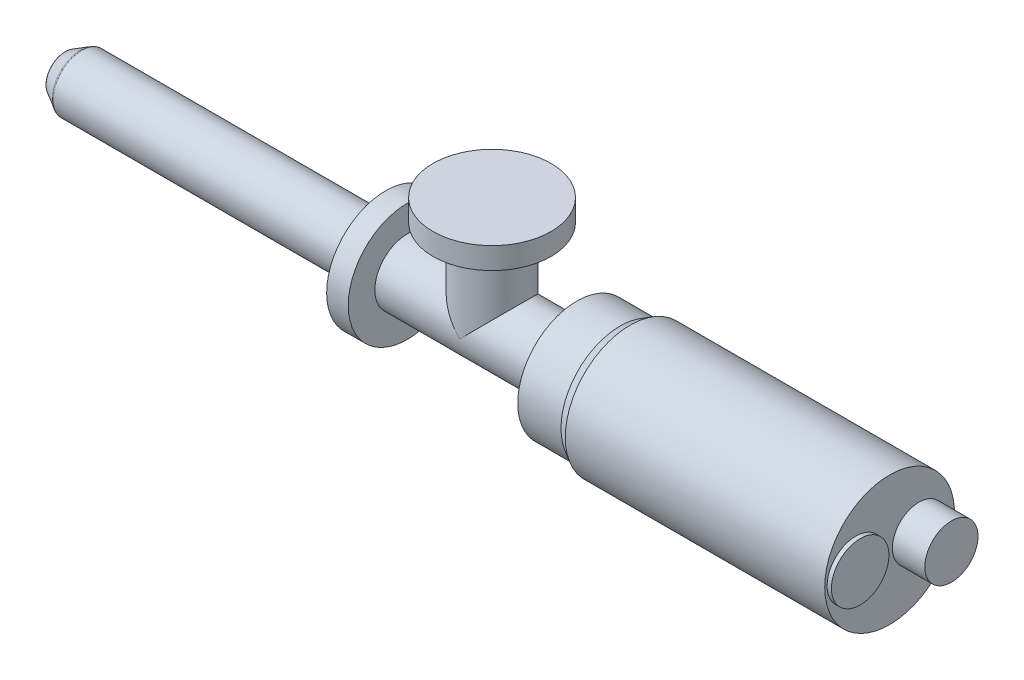
ISO-10303-21;
HEADER;
FILE_DESCRIPTION(('STEP AP214'),'2;1');
FILE_NAME('part.step','',(''),(''),'','','');
FILE_SCHEMA(('AUTOMOTIVE_DESIGN { 1 0 10303 214 1 1 1 1 }'));
ENDSEC;
DATA;
#1=APPLICATION_CONTEXT('core data for automotive mechanical design processes');
#2=APPLICATION_PROTOCOL_DEFINITION('international standard','automotive_design',2000,#1);
#3=PRODUCT_CONTEXT('',#1,'mechanical');
#4=PRODUCT('Part','Part','',(#3));
#5=PRODUCT_RELATED_PRODUCT_CATEGORY('part','',(#4));
#6=PRODUCT_DEFINITION_FORMATION('','',#4);
#7=PRODUCT_DEFINITION_CONTEXT('part definition',#1,'design');
#8=PRODUCT_DEFINITION('design','',#6,#7);
#9=PRODUCT_DEFINITION_SHAPE('','',#8);
#10=(LENGTH_UNIT() NAMED_UNIT(*) SI_UNIT(.MILLI.,.METRE.));
#11=(NAMED_UNIT(*) PLANE_ANGLE_UNIT() SI_UNIT($,.RADIAN.));
#12=(NAMED_UNIT(*) SI_UNIT($,.STERADIAN.) SOLID_ANGLE_UNIT());
#13=UNCERTAINTY_MEASURE_WITH_UNIT(LENGTH_MEASURE(1.E-05),#10,'distance_accuracy_value','');
#14=(GEOMETRIC_REPRESENTATION_CONTEXT(3) GLOBAL_UNCERTAINTY_ASSIGNED_CONTEXT((#13)) GLOBAL_UNIT_ASSIGNED_CONTEXT((#10,
#11,#12)) REPRESENTATION_CONTEXT('',''));
#15=CARTESIAN_POINT('',(0.,0.,0.));
#16=DIRECTION('',(0.,0.,1.));
#17=DIRECTION('',(1.,0.,0.));
#18=AXIS2_PLACEMENT_3D('',#15,#16,#17);
#19=CARTESIAN_POINT('',(484.729202219154,38.1,0.));
#20=DIRECTION('',(-1.,0.,0.));
#21=DIRECTION('',(0.,0.,1.));
#22=AXIS2_PLACEMENT_3D('',#19,#20,#21);
#23=PLANE('',#22);
#24=CARTESIAN_POINT('',(484.729202219154,0.,-17.272));
#25=DIRECTION('',(-1.,0.,0.));
#26=DIRECTION('',(0.,0.,1.));
#27=AXIS2_PLACEMENT_3D('',#24,#25,#26);
#28=CIRCLE('',#27,15.621);
#29=CARTESIAN_POINT('',(484.729202219154,0.,-1.65100000000001));
#30=VERTEX_POINT('',#29);
#31=EDGE_CURVE('E62',#30,#30,#28,.F.);
#32=ORIENTED_EDGE('',*,*,#31,.F.);
#33=EDGE_LOOP('',(#32));
#34=FACE_BOUND('',#33,.T.);
#35=CARTESIAN_POINT('',(484.729202219154,0.,0.));
#36=DIRECTION('',(-1.,0.,0.));
#37=DIRECTION('',(0.,0.,1.));
#38=AXIS2_PLACEMENT_3D('',#35,#36,#37);
#39=CIRCLE('',#38,38.1);
#40=CARTESIAN_POINT('',(484.729202219154,0.,38.1));
#41=VERTEX_POINT('',#40);
#42=EDGE_CURVE('E340',#41,#41,#39,.T.);
#43=ORIENTED_EDGE('',*,*,#42,.F.);
#44=EDGE_LOOP('',(#43));
#45=FACE_BOUND('',#44,.T.);
#46=CARTESIAN_POINT('',(484.729202219154,0.,19.812));
#47=DIRECTION('',(-1.,0.,0.));
#48=DIRECTION('',(0.,0.,1.));
#49=AXIS2_PLACEMENT_3D('',#46,#47,#48);
#50=CIRCLE('',#49,16.891);
#51=CARTESIAN_POINT('',(484.729202219154,0.,36.703));
#52=VERTEX_POINT('',#51);
#53=EDGE_CURVE('E65',#52,#52,#50,.F.);
#54=ORIENTED_EDGE('',*,*,#53,.F.);
#55=EDGE_LOOP('',(#54));
#56=FACE_BOUND('',#55,.T.);
#57=ADVANCED_FACE('F30',(#34,#45,#56),#23,.F.);
#58=CARTESIAN_POINT('',(251.206,62.484,0.));
#59=DIRECTION('',(0.,-1.,0.));
#60=DIRECTION('',(0.,0.,-1.));
#61=AXIS2_PLACEMENT_3D('',#58,#59,#60);
#62=CYLINDRICAL_SURFACE('',#61,19.05);
#63=CARTESIAN_POINT('',(251.206,0.,0.));
#64=DIRECTION('',(-0.707106781186548,0.707106781186547,0.));
#65=DIRECTION('',(-0.707106781186548,-0.707106781186547,0.));
#66=AXIS2_PLACEMENT_3D('',#63,#64,#65);
#67=ELLIPSE('',#66,26.9407683632075,19.05);
#68=CARTESIAN_POINT('',(251.206,0.,19.05));
#69=VERTEX_POINT('',#68);
#70=CARTESIAN_POINT('',(251.206,0.,-19.05));
#71=VERTEX_POINT('',#70);
#72=EDGE_CURVE('E44',#69,#71,#67,.T.);
#73=ORIENTED_EDGE('',*,*,#72,.T.);
#74=CARTESIAN_POINT('',(251.206,0.,0.));
#75=DIRECTION('',(-0.707106781186548,-0.707106781186547,0.));
#76=DIRECTION('',(-0.707106781186548,0.707106781186547,0.));
#77=AXIS2_PLACEMENT_3D('',#74,#75,#76);
#78=ELLIPSE('',#77,26.9407683632075,19.05);
#79=EDGE_CURVE('E46',#71,#69,#78,.F.);
#80=ORIENTED_EDGE('',*,*,#79,.T.);
#81=EDGE_LOOP('',(#73,#80));
#82=FACE_BOUND('',#81,.T.);
#83=CARTESIAN_POINT('',(251.206,49.784,0.));
#84=DIRECTION('',(0.,1.,0.));
#85=DIRECTION('',(0.,0.,1.));
#86=AXIS2_PLACEMENT_3D('',#83,#84,#85);
#87=CIRCLE('',#86,19.05);
#88=CARTESIAN_POINT('',(251.206,49.784,19.05));
#89=VERTEX_POINT('',#88);
#90=EDGE_CURVE('E49',#89,#89,#87,.T.);
#91=ORIENTED_EDGE('',*,*,#90,.F.);
#92=EDGE_LOOP('',(#91));
#93=FACE_BOUND('',#92,.T.);
#94=ADVANCED_FACE('F51',(#82,#93),#62,.T.);
#95=CARTESIAN_POINT('',(0.,0.,0.));
#96=DIRECTION('',(-1.,0.,0.));
#97=DIRECTION('',(0.,0.,1.));
#98=AXIS2_PLACEMENT_3D('',#95,#96,#97);
#99=CYLINDRICAL_SURFACE('',#98,19.05);
#100=CARTESIAN_POINT('',(300.99,0.,0.));
#101=DIRECTION('',(-1.,0.,0.));
#102=DIRECTION('',(0.,0.,1.));
#103=AXIS2_PLACEMENT_3D('',#100,#101,#102);
#104=CIRCLE('',#103,19.05);
#105=CARTESIAN_POINT('',(300.99,0.,19.05));
#106=VERTEX_POINT('',#105);
#107=EDGE_CURVE('E354',#106,#106,#104,.T.);
#108=ORIENTED_EDGE('',*,*,#107,.T.);
#109=EDGE_LOOP('',(#108));
#110=FACE_BOUND('',#109,.T.);
#111=CARTESIAN_POINT('',(201.422,0.,0.));
#112=DIRECTION('',(-1.,0.,0.));
#113=DIRECTION('',(0.,0.,1.));
#114=AXIS2_PLACEMENT_3D('',#111,#112,#113);
#115=CIRCLE('',#114,19.05);
#116=CARTESIAN_POINT('',(201.422,0.,19.05));
#117=VERTEX_POINT('',#116);
#118=EDGE_CURVE('E357',#117,#117,#115,.T.);
#119=ORIENTED_EDGE('',*,*,#118,.F.);
#120=EDGE_LOOP('',(#119));
#121=FACE_BOUND('',#120,.T.);
#122=ORIENTED_EDGE('',*,*,#79,.F.);
#123=ORIENTED_EDGE('',*,*,#72,.F.);
#124=EDGE_LOOP('',(#122,#123));
#125=FACE_BOUND('',#124,.T.);
#126=ADVANCED_FACE('F47',(#110,#121,#125),#99,.T.);
#127=CARTESIAN_POINT('',(0.,0.,0.));
#128=DIRECTION('',(1.,0.,0.));
#129=DIRECTION('',(0.,0.,-1.));
#130=AXIS2_PLACEMENT_3D('',#127,#128,#129);
#131=PLANE('',#130);
#132=CARTESIAN_POINT('',(0.,0.,0.));
#133=DIRECTION('',(-1.,0.,0.));
#134=DIRECTION('',(0.,0.,1.));
#135=AXIS2_PLACEMENT_3D('',#132,#133,#134);
#136=CIRCLE('',#135,3.175);
#137=CARTESIAN_POINT('',(0.,0.,3.175));
#138=VERTEX_POINT('',#137);
#139=EDGE_CURVE('E326',#138,#138,#136,.T.);
#140=ORIENTED_EDGE('',*,*,#139,.F.);
#141=EDGE_LOOP('',(#140));
#142=FACE_BOUND('',#141,.T.);
#143=CARTESIAN_POINT('',(0.,0.,0.));
#144=DIRECTION('',(1.,0.,0.));
#145=DIRECTION('',(0.,0.,-1.));
#146=AXIS2_PLACEMENT_3D('',#143,#144,#145);
#147=CIRCLE('',#146,10.169118189755);
#148=CARTESIAN_POINT('',(0.,0.,-10.169118189755));
#149=VERTEX_POINT('',#148);
#150=EDGE_CURVE('E11',#149,#149,#147,.F.);
#151=ORIENTED_EDGE('',*,*,#150,.T.);
#152=EDGE_LOOP('',(#151));
#153=FACE_BOUND('',#152,.T.);
#154=ADVANCED_FACE('F88',(#142,#153),#131,.F.);
#155=CARTESIAN_POINT('',(9.7226940032071,0.,0.));
#156=DIRECTION('',(1.,0.,0.));
#157=DIRECTION('',(0.,0.,-1.));
#158=AXIS2_PLACEMENT_3D('',#155,#156,#157);
#159=CONICAL_SURFACE('',#158,16.6624,0.5235987755983);
#160=CARTESIAN_POINT('',(9.36904857247214,0.,0.));
#161=DIRECTION('',(-1.,0.,0.));
#162=DIRECTION('',(0.,0.,1.));
#163=AXIS2_PLACEMENT_3D('',#160,#161,#162);
#164=CIRCLE('',#163,16.4582227153675);
#165=CARTESIAN_POINT('',(9.36904857247214,0.,16.4582227153675));
#166=VERTEX_POINT('',#165);
#167=EDGE_CURVE('E71',#166,#166,#164,.T.);
#168=ORIENTED_EDGE('',*,*,#167,.T.);
#169=EDGE_LOOP('',(#168));
#170=FACE_BOUND('',#169,.T.);
#171=CARTESIAN_POINT('',(0.761999999999995,0.,0.));
#172=DIRECTION('',(-1.,0.,0.));
#173=DIRECTION('',(0.,0.,1.));
#174=AXIS2_PLACEMENT_3D('',#171,#172,#173);
#175=CIRCLE('',#174,11.4889409051225);
#176=CARTESIAN_POINT('',(0.761999999999995,0.,11.4889409051225));
#177=VERTEX_POINT('',#176);
#178=EDGE_CURVE('E68',#177,#177,#175,.F.);
#179=ORIENTED_EDGE('',*,*,#178,.T.);
#180=EDGE_LOOP('',(#179));
#181=FACE_BOUND('',#180,.T.);
#182=ADVANCED_FACE('F85',(#170,#181),#159,.T.);
#183=CARTESIAN_POINT('',(0.,0.,0.));
#184=DIRECTION('',(-1.,0.,0.));
#185=DIRECTION('',(0.,0.,1.));
#186=AXIS2_PLACEMENT_3D('',#183,#184,#185);
#187=CYLINDRICAL_SURFACE('',#186,16.6624);
#188=CARTESIAN_POINT('',(10.1310485724721,0.,0.));
#189=DIRECTION('',(1.,0.,0.));
#190=DIRECTION('',(0.,0.,-1.));
#191=AXIS2_PLACEMENT_3D('',#188,#189,#190);
#192=CIRCLE('',#191,16.6624);
#193=CARTESIAN_POINT('',(10.1310485724721,0.,-16.6624));
#194=VERTEX_POINT('',#193);
#195=EDGE_CURVE('E38',#194,#194,#192,.T.);
#196=ORIENTED_EDGE('',*,*,#195,.T.);
#197=EDGE_LOOP('',(#196));
#198=FACE_BOUND('',#197,.T.);
#199=CARTESIAN_POINT('',(188.722,0.,0.));
#200=DIRECTION('',(-1.,0.,0.));
#201=DIRECTION('',(0.,0.,1.));
#202=AXIS2_PLACEMENT_3D('',#199,#200,#201);
#203=CIRCLE('',#202,16.6624);
#204=CARTESIAN_POINT('',(188.722,0.,16.6624));
#205=VERTEX_POINT('',#204);
#206=EDGE_CURVE('E53',#205,#205,#203,.T.);
#207=ORIENTED_EDGE('',*,*,#206,.T.);
#208=EDGE_LOOP('',(#207));
#209=FACE_BOUND('',#208,.T.);
#210=ADVANCED_FACE('F76',(#198,#209),#187,.T.);
#211=CARTESIAN_POINT('',(188.722,16.6624,0.));
#212=DIRECTION('',(1.,0.,0.));
#213=DIRECTION('',(0.,0.,-1.));
#214=AXIS2_PLACEMENT_3D('',#211,#212,#213);
#215=PLANE('',#214);
#216=ORIENTED_EDGE('',*,*,#206,.F.);
#217=EDGE_LOOP('',(#216));
#218=FACE_BOUND('',#217,.T.);
#219=CARTESIAN_POINT('',(188.722,0.,0.));
#220=DIRECTION('',(-1.,0.,0.));
#221=DIRECTION('',(0.,0.,1.));
#222=AXIS2_PLACEMENT_3D('',#219,#220,#221);
#223=CIRCLE('',#222,34.671);
#224=CARTESIAN_POINT('',(188.722,0.,34.671));
#225=VERTEX_POINT('',#224);
#226=EDGE_CURVE('E56',#225,#225,#223,.T.);
#227=ORIENTED_EDGE('',*,*,#226,.T.);
#228=EDGE_LOOP('',(#227));
#229=FACE_BOUND('',#228,.T.);
#230=ADVANCED_FACE('F141',(#218,#229),#215,.F.);
#231=CARTESIAN_POINT('',(0.,0.,0.));
#232=DIRECTION('',(-1.,0.,0.));
#233=DIRECTION('',(0.,0.,1.));
#234=AXIS2_PLACEMENT_3D('',#231,#232,#233);
#235=CYLINDRICAL_SURFACE('',#234,34.671);
#236=ORIENTED_EDGE('',*,*,#226,.F.);
#237=EDGE_LOOP('',(#236));
#238=FACE_BOUND('',#237,.T.);
#239=CARTESIAN_POINT('',(201.422,0.,0.));
#240=DIRECTION('',(-1.,0.,0.));
#241=DIRECTION('',(0.,0.,1.));
#242=AXIS2_PLACEMENT_3D('',#239,#240,#241);
#243=CIRCLE('',#242,34.671);
#244=CARTESIAN_POINT('',(201.422,0.,34.671));
#245=VERTEX_POINT('',#244);
#246=EDGE_CURVE('E360',#245,#245,#243,.T.);
#247=ORIENTED_EDGE('',*,*,#246,.T.);
#248=EDGE_LOOP('',(#247));
#249=FACE_BOUND('',#248,.T.);
#250=ADVANCED_FACE('F137',(#238,#249),#235,.T.);
#251=CARTESIAN_POINT('',(201.422,34.671,0.));
#252=DIRECTION('',(-1.,0.,0.));
#253=DIRECTION('',(0.,0.,1.));
#254=AXIS2_PLACEMENT_3D('',#251,#252,#253);
#255=PLANE('',#254);
#256=ORIENTED_EDGE('',*,*,#246,.F.);
#257=EDGE_LOOP('',(#256));
#258=FACE_BOUND('',#257,.T.);
#259=ORIENTED_EDGE('',*,*,#118,.T.);
#260=EDGE_LOOP('',(#259));
#261=FACE_BOUND('',#260,.T.);
#262=ADVANCED_FACE('F132',(#258,#261),#255,.F.);
#263=CARTESIAN_POINT('',(300.99,19.05,0.));
#264=DIRECTION('',(1.,0.,0.));
#265=DIRECTION('',(0.,0.,-1.));
#266=AXIS2_PLACEMENT_3D('',#263,#264,#265);
#267=PLANE('',#266);
#268=ORIENTED_EDGE('',*,*,#107,.F.);
#269=EDGE_LOOP('',(#268));
#270=FACE_BOUND('',#269,.T.);
#271=CARTESIAN_POINT('',(300.99,0.,0.));
#272=DIRECTION('',(-1.,0.,0.));
#273=DIRECTION('',(0.,0.,1.));
#274=AXIS2_PLACEMENT_3D('',#271,#272,#273);
#275=CIRCLE('',#274,34.671);
#276=CARTESIAN_POINT('',(300.99,0.,34.671));
#277=VERTEX_POINT('',#276);
#278=EDGE_CURVE('E351',#277,#277,#275,.T.);
#279=ORIENTED_EDGE('',*,*,#278,.T.);
#280=EDGE_LOOP('',(#279));
#281=FACE_BOUND('',#280,.T.);
#282=ADVANCED_FACE('F129',(#270,#281),#267,.F.);
#283=CARTESIAN_POINT('',(0.,0.,0.));
#284=DIRECTION('',(-1.,0.,0.));
#285=DIRECTION('',(0.,0.,1.));
#286=AXIS2_PLACEMENT_3D('',#283,#284,#285);
#287=CYLINDRICAL_SURFACE('',#286,34.671);
#288=ORIENTED_EDGE('',*,*,#278,.F.);
#289=EDGE_LOOP('',(#288));
#290=FACE_BOUND('',#289,.T.);
#291=CARTESIAN_POINT('',(326.39,0.,0.));
#292=DIRECTION('',(-1.,0.,0.));
#293=DIRECTION('',(0.,0.,1.));
#294=AXIS2_PLACEMENT_3D('',#291,#292,#293);
#295=CIRCLE('',#294,34.671);
#296=CARTESIAN_POINT('',(326.39,0.,34.671));
#297=VERTEX_POINT('',#296);
#298=EDGE_CURVE('E348',#297,#297,#295,.T.);
#299=ORIENTED_EDGE('',*,*,#298,.T.);
#300=EDGE_LOOP('',(#299));
#301=FACE_BOUND('',#300,.T.);
#302=ADVANCED_FACE('F125',(#290,#301),#287,.T.);
#303=CARTESIAN_POINT('',(332.329202219154,0.,0.));
#304=DIRECTION('',(1.,0.,0.));
#305=DIRECTION('',(0.,0.,-1.));
#306=AXIS2_PLACEMENT_3D('',#303,#304,#305);
#307=CONICAL_SURFACE('',#306,38.1,0.5235987755983);
#308=ORIENTED_EDGE('',*,*,#298,.F.);
#309=EDGE_LOOP('',(#308));
#310=FACE_BOUND('',#309,.T.);
#311=CARTESIAN_POINT('',(332.329202219154,0.,0.));
#312=DIRECTION('',(-1.,0.,0.));
#313=DIRECTION('',(0.,0.,1.));
#314=AXIS2_PLACEMENT_3D('',#311,#312,#313);
#315=CIRCLE('',#314,38.1);
#316=CARTESIAN_POINT('',(332.329202219154,0.,38.1));
#317=VERTEX_POINT('',#316);
#318=EDGE_CURVE('E345',#317,#317,#315,.T.);
#319=ORIENTED_EDGE('',*,*,#318,.T.);
#320=EDGE_LOOP('',(#319));
#321=FACE_BOUND('',#320,.T.);
#322=ADVANCED_FACE('F121',(#310,#321),#307,.T.);
#323=CARTESIAN_POINT('',(0.,0.,0.));
#324=DIRECTION('',(-1.,0.,0.));
#325=DIRECTION('',(0.,0.,1.));
#326=AXIS2_PLACEMENT_3D('',#323,#324,#325);
#327=CYLINDRICAL_SURFACE('',#326,38.1);
#328=ORIENTED_EDGE('',*,*,#318,.F.);
#329=EDGE_LOOP('',(#328));
#330=FACE_BOUND('',#329,.T.);
#331=ORIENTED_EDGE('',*,*,#42,.T.);
#332=EDGE_LOOP('',(#331));
#333=FACE_BOUND('',#332,.T.);
#334=ADVANCED_FACE('F117',(#330,#333),#327,.T.);
#335=CARTESIAN_POINT('',(251.206,49.784,0.));
#336=DIRECTION('',(0.,1.,0.));
#337=DIRECTION('',(0.,0.,1.));
#338=AXIS2_PLACEMENT_3D('',#335,#336,#337);
#339=PLANE('',#338);
#340=CARTESIAN_POINT('',(251.206,49.784,0.));
#341=DIRECTION('',(0.,1.,0.));
#342=DIRECTION('',(0.,0.,1.));
#343=AXIS2_PLACEMENT_3D('',#340,#341,#342);
#344=CIRCLE('',#343,34.671);
#345=CARTESIAN_POINT('',(251.206,49.784,34.671));
#346=VERTEX_POINT('',#345);
#347=EDGE_CURVE('E337',#346,#346,#344,.T.);
#348=ORIENTED_EDGE('',*,*,#347,.F.);
#349=EDGE_LOOP('',(#348));
#350=FACE_BOUND('',#349,.T.);
#351=ORIENTED_EDGE('',*,*,#90,.T.);
#352=EDGE_LOOP('',(#351));
#353=FACE_BOUND('',#352,.T.);
#354=ADVANCED_FACE('F120',(#350,#353),#339,.F.);
#355=CARTESIAN_POINT('',(251.206,49.784,0.));
#356=DIRECTION('',(0.,1.,0.));
#357=DIRECTION('',(0.,0.,1.));
#358=AXIS2_PLACEMENT_3D('',#355,#356,#357);
#359=CYLINDRICAL_SURFACE('',#358,34.671);
#360=ORIENTED_EDGE('',*,*,#347,.T.);
#361=EDGE_LOOP('',(#360));
#362=FACE_BOUND('',#361,.T.);
#363=CARTESIAN_POINT('',(251.206,62.484,0.));
#364=DIRECTION('',(0.,1.,0.));
#365=DIRECTION('',(0.,0.,1.));
#366=AXIS2_PLACEMENT_3D('',#363,#364,#365);
#367=CIRCLE('',#366,34.671);
#368=CARTESIAN_POINT('',(251.206,62.484,34.671));
#369=VERTEX_POINT('',#368);
#370=EDGE_CURVE('E336',#369,#369,#367,.T.);
#371=ORIENTED_EDGE('',*,*,#370,.F.);
#372=EDGE_LOOP('',(#371));
#373=FACE_BOUND('',#372,.T.);
#374=ADVANCED_FACE('F187',(#362,#373),#359,.T.);
#375=CARTESIAN_POINT('',(251.206,62.484,0.));
#376=DIRECTION('',(0.,1.,0.));
#377=DIRECTION('',(0.,0.,1.));
#378=AXIS2_PLACEMENT_3D('',#375,#376,#377);
#379=PLANE('',#378);
#380=ORIENTED_EDGE('',*,*,#370,.T.);
#381=EDGE_LOOP('',(#380));
#382=FACE_BOUND('',#381,.T.);
#383=ADVANCED_FACE('F196',(#382),#379,.T.);
#384=CARTESIAN_POINT('',(503.779202219154,0.,-17.272));
#385=DIRECTION('',(-1.,0.,0.));
#386=DIRECTION('',(0.,0.,1.));
#387=AXIS2_PLACEMENT_3D('',#384,#385,#386);
#388=CYLINDRICAL_SURFACE('',#387,15.621);
#389=CARTESIAN_POINT('',(503.779202219154,0.,-17.272));
#390=DIRECTION('',(1.,0.,0.));
#391=DIRECTION('',(0.,0.,-1.));
#392=AXIS2_PLACEMENT_3D('',#389,#390,#391);
#393=CIRCLE('',#392,15.621);
#394=CARTESIAN_POINT('',(503.779202219154,0.,-32.893));
#395=VERTEX_POINT('',#394);
#396=EDGE_CURVE('E329',#395,#395,#393,.T.);
#397=ORIENTED_EDGE('',*,*,#396,.F.);
#398=EDGE_LOOP('',(#397));
#399=FACE_BOUND('',#398,.T.);
#400=ORIENTED_EDGE('',*,*,#31,.T.);
#401=EDGE_LOOP('',(#400));
#402=FACE_BOUND('',#401,.T.);
#403=ADVANCED_FACE('F204',(#399,#402),#388,.T.);
#404=CARTESIAN_POINT('',(503.779202219154,0.,-17.272));
#405=DIRECTION('',(1.,0.,0.));
#406=DIRECTION('',(0.,0.,-1.));
#407=AXIS2_PLACEMENT_3D('',#404,#405,#406);
#408=PLANE('',#407);
#409=ORIENTED_EDGE('',*,*,#396,.T.);
#410=EDGE_LOOP('',(#409));
#411=FACE_BOUND('',#410,.T.);
#412=ADVANCED_FACE('F211',(#411),#408,.T.);
#413=CARTESIAN_POINT('',(487.269202219154,0.,19.812));
#414=DIRECTION('',(-1.,0.,0.));
#415=DIRECTION('',(0.,0.,1.));
#416=AXIS2_PLACEMENT_3D('',#413,#414,#415);
#417=CYLINDRICAL_SURFACE('',#416,16.891);
#418=CARTESIAN_POINT('',(487.269202219154,0.,19.812));
#419=DIRECTION('',(1.,0.,0.));
#420=DIRECTION('',(0.,0.,-1.));
#421=AXIS2_PLACEMENT_3D('',#418,#419,#420);
#422=CIRCLE('',#421,16.891);
#423=CARTESIAN_POINT('',(487.269202219154,0.,2.921));
#424=VERTEX_POINT('',#423);
#425=EDGE_CURVE('E325',#424,#424,#422,.T.);
#426=ORIENTED_EDGE('',*,*,#425,.F.);
#427=EDGE_LOOP('',(#426));
#428=FACE_BOUND('',#427,.T.);
#429=ORIENTED_EDGE('',*,*,#53,.T.);
#430=EDGE_LOOP('',(#429));
#431=FACE_BOUND('',#430,.T.);
#432=ADVANCED_FACE('F219',(#428,#431),#417,.T.);
#433=CARTESIAN_POINT('',(487.269202219154,0.,19.812));
#434=DIRECTION('',(1.,0.,0.));
#435=DIRECTION('',(0.,0.,-1.));
#436=AXIS2_PLACEMENT_3D('',#433,#434,#435);
#437=PLANE('',#436);
#438=ORIENTED_EDGE('',*,*,#425,.T.);
#439=EDGE_LOOP('',(#438));
#440=FACE_BOUND('',#439,.T.);
#441=ADVANCED_FACE('F82',(#440),#437,.T.);
#442=CARTESIAN_POINT('',(10.1310485724721,0.,0.));
#443=DIRECTION('',(1.,0.,0.));
#444=DIRECTION('',(0.,0.,-1.));
#445=AXIS2_PLACEMENT_3D('',#442,#443,#444);
#446=TOROIDAL_SURFACE('',#445,15.1384,1.524);
#447=ORIENTED_EDGE('',*,*,#195,.F.);
#448=EDGE_LOOP('',(#447));
#449=FACE_BOUND('',#448,.T.);
#450=ORIENTED_EDGE('',*,*,#167,.F.);
#451=EDGE_LOOP('',(#450));
#452=FACE_BOUND('',#451,.T.);
#453=ADVANCED_FACE('F79',(#449,#452),#446,.T.);
#454=CARTESIAN_POINT('',(1.524,0.,0.));
#455=DIRECTION('',(1.,0.,0.));
#456=DIRECTION('',(0.,0.,-1.));
#457=AXIS2_PLACEMENT_3D('',#454,#455,#456);
#458=TOROIDAL_SURFACE('',#457,10.169118189755,1.524);
#459=ORIENTED_EDGE('',*,*,#178,.F.);
#460=EDGE_LOOP('',(#459));
#461=FACE_BOUND('',#460,.T.);
#462=ORIENTED_EDGE('',*,*,#150,.F.);
#463=EDGE_LOOP('',(#462));
#464=FACE_BOUND('',#463,.T.);
#465=ADVANCED_FACE('F32',(#461,#464),#458,.T.);
#466=CARTESIAN_POINT('',(12.7,0.,0.));
#467=DIRECTION('',(-1.,0.,0.));
#468=DIRECTION('',(0.,0.,1.));
#469=AXIS2_PLACEMENT_3D('',#466,#467,#468);
#470=CYLINDRICAL_SURFACE('',#469,3.175);
#471=CARTESIAN_POINT('',(12.7,0.,0.));
#472=DIRECTION('',(-1.,0.,0.));
#473=DIRECTION('',(0.,0.,1.));
#474=AXIS2_PLACEMENT_3D('',#471,#472,#473);
#475=CIRCLE('',#474,3.175);
#476=CARTESIAN_POINT('',(12.7,0.,3.175));
#477=VERTEX_POINT('',#476);
#478=EDGE_CURVE('E324',#477,#477,#475,.T.);
#479=ORIENTED_EDGE('',*,*,#478,.F.);
#480=EDGE_LOOP('',(#479));
#481=FACE_BOUND('',#480,.T.);
#482=ORIENTED_EDGE('',*,*,#139,.T.);
#483=EDGE_LOOP('',(#482));
#484=FACE_BOUND('',#483,.T.);
#485=ADVANCED_FACE('F94',(#481,#484),#470,.F.);
#486=CARTESIAN_POINT('',(12.7,0.,0.));
#487=DIRECTION('',(-1.,0.,0.));
#488=DIRECTION('',(0.,0.,1.));
#489=AXIS2_PLACEMENT_3D('',#486,#487,#488);
#490=PLANE('',#489);
#491=ORIENTED_EDGE('',*,*,#478,.T.);
#492=EDGE_LOOP('',(#491));
#493=FACE_BOUND('',#492,.T.);
#494=ADVANCED_FACE('F248',(#493),#490,.T.);
#495=CLOSED_SHELL('',(#57,#94,#126,#154,#182,#210,#230,#250,#262,#282,#302,#322,#334,#354,#374,
#383,#403,#412,#432,#441,#453,#465,#485,#494));
#496=MANIFOLD_SOLID_BREP('B2',#495);
#497=ADVANCED_BREP_SHAPE_REPRESENTATION('',(#18,#496),#14);
#498=SHAPE_DEFINITION_REPRESENTATION(#9,#497);
ENDSEC;
END-ISO-10303-21;
